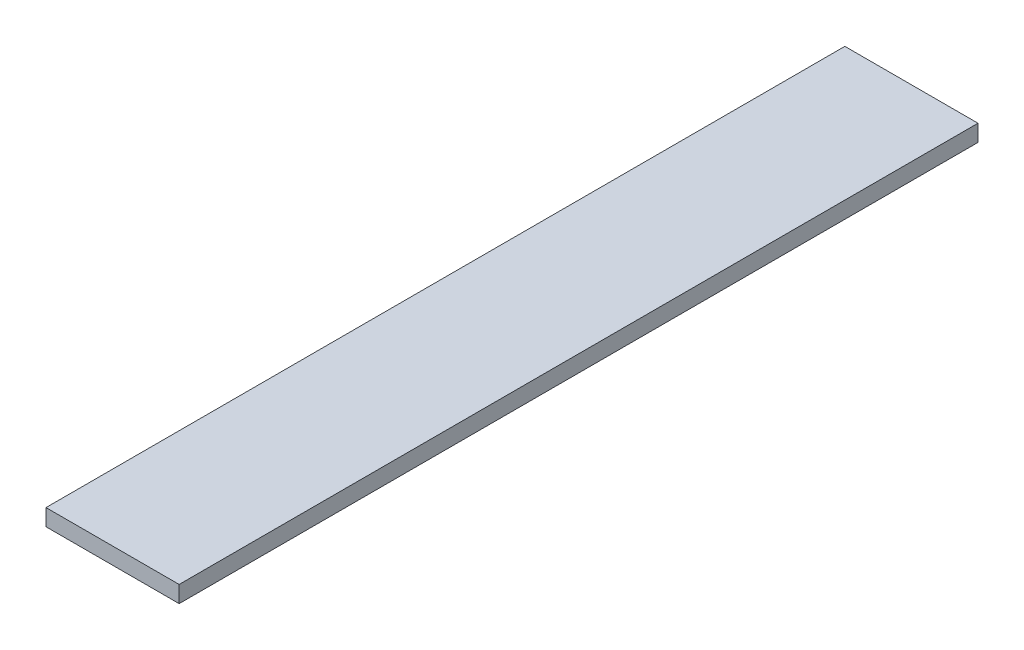
ISO-10303-21;
HEADER;
FILE_DESCRIPTION(('STEP AP214'),'2;1');
FILE_NAME('part.step','',(''),(''),'','','');
FILE_SCHEMA(('AUTOMOTIVE_DESIGN { 1 0 10303 214 1 1 1 1 }'));
ENDSEC;
DATA;
#1=APPLICATION_CONTEXT('core data for automotive mechanical design processes');
#2=APPLICATION_PROTOCOL_DEFINITION('international standard','automotive_design',2000,#1);
#3=PRODUCT_CONTEXT('',#1,'mechanical');
#4=PRODUCT('Part','Part','',(#3));
#5=PRODUCT_RELATED_PRODUCT_CATEGORY('part','',(#4));
#6=PRODUCT_DEFINITION_FORMATION('','',#4);
#7=PRODUCT_DEFINITION_CONTEXT('part definition',#1,'design');
#8=PRODUCT_DEFINITION('design','',#6,#7);
#9=PRODUCT_DEFINITION_SHAPE('','',#8);
#10=(LENGTH_UNIT() NAMED_UNIT(*) SI_UNIT(.MILLI.,.METRE.));
#11=(NAMED_UNIT(*) PLANE_ANGLE_UNIT() SI_UNIT($,.RADIAN.));
#12=(NAMED_UNIT(*) SI_UNIT($,.STERADIAN.) SOLID_ANGLE_UNIT());
#13=UNCERTAINTY_MEASURE_WITH_UNIT(LENGTH_MEASURE(1.E-05),#10,'distance_accuracy_value','');
#14=(GEOMETRIC_REPRESENTATION_CONTEXT(3) GLOBAL_UNCERTAINTY_ASSIGNED_CONTEXT((#13)) GLOBAL_UNIT_ASSIGNED_CONTEXT((#10,
#11,#12)) REPRESENTATION_CONTEXT('',''));
#15=CARTESIAN_POINT('',(0.,0.,0.));
#16=DIRECTION('',(0.,0.,1.));
#17=DIRECTION('',(1.,0.,0.));
#18=AXIS2_PLACEMENT_3D('',#15,#16,#17);
#19=CARTESIAN_POINT('',(0.,6.35,0.));
#20=DIRECTION('',(1.,0.,0.));
#21=DIRECTION('',(0.,0.,-1.));
#22=AXIS2_PLACEMENT_3D('',#19,#20,#21);
#23=PLANE('',#22);
#24=DIRECTION('',(0.,0.,1.));
#25=VECTOR('',#24,1.);
#26=CARTESIAN_POINT('',(0.,0.,0.));
#27=LINE('',#26,#25);
#28=CARTESIAN_POINT('',(0.,0.,-304.8));
#29=VERTEX_POINT('',#28);
#30=CARTESIAN_POINT('',(0.,0.,0.));
#31=VERTEX_POINT('',#30);
#32=EDGE_CURVE('E80',#29,#31,#27,.T.);
#33=ORIENTED_EDGE('',*,*,#32,.T.);
#34=DIRECTION('',(0.,-1.,0.));
#35=VECTOR('',#34,1.);
#36=CARTESIAN_POINT('',(0.,6.35,0.));
#37=LINE('',#36,#35);
#38=CARTESIAN_POINT('',(0.,6.35,0.));
#39=VERTEX_POINT('',#38);
#40=EDGE_CURVE('E11',#39,#31,#37,.T.);
#41=ORIENTED_EDGE('',*,*,#40,.F.);
#42=DIRECTION('',(0.,0.,1.));
#43=VECTOR('',#42,1.);
#44=CARTESIAN_POINT('',(0.,6.35,0.));
#45=LINE('',#44,#43);
#46=CARTESIAN_POINT('',(0.,6.35,-304.8));
#47=VERTEX_POINT('',#46);
#48=EDGE_CURVE('E68',#47,#39,#45,.T.);
#49=ORIENTED_EDGE('',*,*,#48,.F.);
#50=DIRECTION('',(0.,-1.,0.));
#51=VECTOR('',#50,1.);
#52=CARTESIAN_POINT('',(0.,6.35,-304.8));
#53=LINE('',#52,#51);
#54=EDGE_CURVE('E76',#47,#29,#53,.T.);
#55=ORIENTED_EDGE('',*,*,#54,.T.);
#56=EDGE_LOOP('',(#33,#41,#49,#55));
#57=FACE_BOUND('',#56,.T.);
#58=ADVANCED_FACE('F17',(#57),#23,.F.);
#59=CARTESIAN_POINT('',(0.,6.35,0.));
#60=DIRECTION('',(0.,0.,-1.));
#61=DIRECTION('',(-1.,0.,0.));
#62=AXIS2_PLACEMENT_3D('',#59,#60,#61);
#63=PLANE('',#62);
#64=DIRECTION('',(1.,0.,0.));
#65=VECTOR('',#64,1.);
#66=CARTESIAN_POINT('',(0.,0.,0.));
#67=LINE('',#66,#65);
#68=CARTESIAN_POINT('',(50.8,0.,0.));
#69=VERTEX_POINT('',#68);
#70=EDGE_CURVE('E72',#31,#69,#67,.T.);
#71=ORIENTED_EDGE('',*,*,#70,.T.);
#72=DIRECTION('',(0.,-1.,0.));
#73=VECTOR('',#72,1.);
#74=CARTESIAN_POINT('',(50.8,6.35,0.));
#75=LINE('',#74,#73);
#76=CARTESIAN_POINT('',(50.8,6.35,0.));
#77=VERTEX_POINT('',#76);
#78=EDGE_CURVE('E25',#77,#69,#75,.T.);
#79=ORIENTED_EDGE('',*,*,#78,.F.);
#80=DIRECTION('',(1.,0.,0.));
#81=VECTOR('',#80,1.);
#82=CARTESIAN_POINT('',(0.,6.35,0.));
#83=LINE('',#82,#81);
#84=EDGE_CURVE('E63',#39,#77,#83,.T.);
#85=ORIENTED_EDGE('',*,*,#84,.F.);
#86=ORIENTED_EDGE('',*,*,#40,.T.);
#87=EDGE_LOOP('',(#71,#79,#85,#86));
#88=FACE_BOUND('',#87,.T.);
#89=ADVANCED_FACE('F71',(#88),#63,.F.);
#90=CARTESIAN_POINT('',(50.8,6.35,0.));
#91=DIRECTION('',(-1.,0.,0.));
#92=DIRECTION('',(0.,0.,1.));
#93=AXIS2_PLACEMENT_3D('',#90,#91,#92);
#94=PLANE('',#93);
#95=DIRECTION('',(0.,0.,-1.));
#96=VECTOR('',#95,1.);
#97=CARTESIAN_POINT('',(50.8,0.,0.));
#98=LINE('',#97,#96);
#99=CARTESIAN_POINT('',(50.8,0.,-304.8));
#100=VERTEX_POINT('',#99);
#101=EDGE_CURVE('E50',#69,#100,#98,.T.);
#102=ORIENTED_EDGE('',*,*,#101,.T.);
#103=DIRECTION('',(0.,-1.,0.));
#104=VECTOR('',#103,1.);
#105=CARTESIAN_POINT('',(50.8,6.35,-304.8));
#106=LINE('',#105,#104);
#107=CARTESIAN_POINT('',(50.8,6.35,-304.8));
#108=VERTEX_POINT('',#107);
#109=EDGE_CURVE('E73',#108,#100,#106,.T.);
#110=ORIENTED_EDGE('',*,*,#109,.F.);
#111=DIRECTION('',(0.,0.,-1.));
#112=VECTOR('',#111,1.);
#113=CARTESIAN_POINT('',(50.8,6.35,0.));
#114=LINE('',#113,#112);
#115=EDGE_CURVE('E66',#77,#108,#114,.T.);
#116=ORIENTED_EDGE('',*,*,#115,.F.);
#117=ORIENTED_EDGE('',*,*,#78,.T.);
#118=EDGE_LOOP('',(#102,#110,#116,#117));
#119=FACE_BOUND('',#118,.T.);
#120=ADVANCED_FACE('F74',(#119),#94,.F.);
#121=CARTESIAN_POINT('',(0.,6.35,-304.8));
#122=DIRECTION('',(0.,0.,1.));
#123=DIRECTION('',(1.,0.,0.));
#124=AXIS2_PLACEMENT_3D('',#121,#122,#123);
#125=PLANE('',#124);
#126=DIRECTION('',(-1.,0.,0.));
#127=VECTOR('',#126,1.);
#128=CARTESIAN_POINT('',(0.,0.,-304.8));
#129=LINE('',#128,#127);
#130=EDGE_CURVE('E56',#100,#29,#129,.T.);
#131=ORIENTED_EDGE('',*,*,#130,.T.);
#132=ORIENTED_EDGE('',*,*,#54,.F.);
#133=DIRECTION('',(-1.,0.,0.));
#134=VECTOR('',#133,1.);
#135=CARTESIAN_POINT('',(0.,6.35,-304.8));
#136=LINE('',#135,#134);
#137=EDGE_CURVE('E33',#108,#47,#136,.T.);
#138=ORIENTED_EDGE('',*,*,#137,.F.);
#139=ORIENTED_EDGE('',*,*,#109,.T.);
#140=EDGE_LOOP('',(#131,#132,#138,#139));
#141=FACE_BOUND('',#140,.T.);
#142=ADVANCED_FACE('F87',(#141),#125,.F.);
#143=CARTESIAN_POINT('',(0.,6.35,-304.8));
#144=DIRECTION('',(0.,-1.,0.));
#145=DIRECTION('',(0.,0.,-1.));
#146=AXIS2_PLACEMENT_3D('',#143,#144,#145);
#147=PLANE('',#146);
#148=ORIENTED_EDGE('',*,*,#48,.T.);
#149=ORIENTED_EDGE('',*,*,#84,.T.);
#150=ORIENTED_EDGE('',*,*,#115,.T.);
#151=ORIENTED_EDGE('',*,*,#137,.T.);
#152=EDGE_LOOP('',(#148,#149,#150,#151));
#153=FACE_BOUND('',#152,.T.);
#154=ADVANCED_FACE('F64',(#153),#147,.F.);
#155=CARTESIAN_POINT('',(0.,0.,-304.8));
#156=DIRECTION('',(0.,-1.,0.));
#157=DIRECTION('',(0.,0.,-1.));
#158=AXIS2_PLACEMENT_3D('',#155,#156,#157);
#159=PLANE('',#158);
#160=ORIENTED_EDGE('',*,*,#32,.F.);
#161=ORIENTED_EDGE('',*,*,#130,.F.);
#162=ORIENTED_EDGE('',*,*,#101,.F.);
#163=ORIENTED_EDGE('',*,*,#70,.F.);
#164=EDGE_LOOP('',(#160,#161,#162,#163));
#165=FACE_BOUND('',#164,.T.);
#166=ADVANCED_FACE('F90',(#165),#159,.T.);
#167=CLOSED_SHELL('',(#58,#89,#120,#142,#154,#166));
#168=MANIFOLD_SOLID_BREP('B1',#167);
#169=ADVANCED_BREP_SHAPE_REPRESENTATION('',(#18,#168),#14);
#170=SHAPE_DEFINITION_REPRESENTATION(#9,#169);
ENDSEC;
END-ISO-10303-21;
